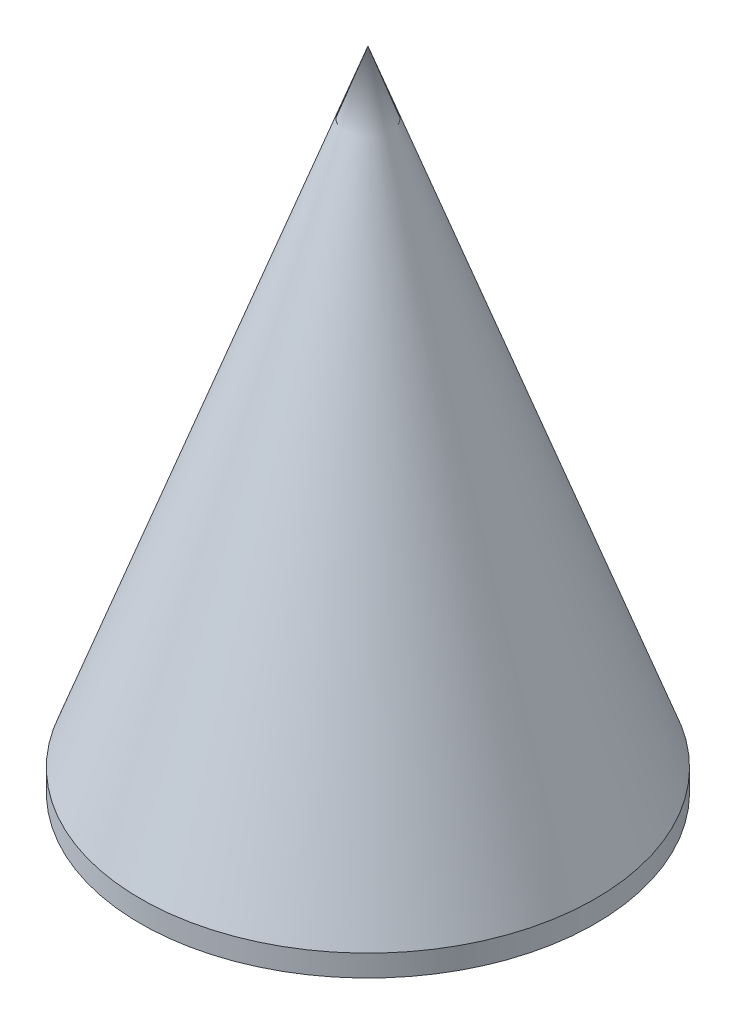
ISO-10303-21;
HEADER;
FILE_DESCRIPTION(('STEP AP214'),'2;1');
FILE_NAME('part.step','',(''),(''),'','','');
FILE_SCHEMA(('AUTOMOTIVE_DESIGN { 1 0 10303 214 1 1 1 1 }'));
ENDSEC;
DATA;
#1=APPLICATION_CONTEXT('core data for automotive mechanical design processes');
#2=APPLICATION_PROTOCOL_DEFINITION('international standard','automotive_design',2000,#1);
#3=PRODUCT_CONTEXT('',#1,'mechanical');
#4=PRODUCT('Part','Part','',(#3));
#5=PRODUCT_RELATED_PRODUCT_CATEGORY('part','',(#4));
#6=PRODUCT_DEFINITION_FORMATION('','',#4);
#7=PRODUCT_DEFINITION_CONTEXT('part definition',#1,'design');
#8=PRODUCT_DEFINITION('design','',#6,#7);
#9=PRODUCT_DEFINITION_SHAPE('','',#8);
#10=(LENGTH_UNIT() NAMED_UNIT(*) SI_UNIT(.MILLI.,.METRE.));
#11=(NAMED_UNIT(*) PLANE_ANGLE_UNIT() SI_UNIT($,.RADIAN.));
#12=(NAMED_UNIT(*) SI_UNIT($,.STERADIAN.) SOLID_ANGLE_UNIT());
#13=UNCERTAINTY_MEASURE_WITH_UNIT(LENGTH_MEASURE(1.E-05),#10,'distance_accuracy_value','');
#14=(GEOMETRIC_REPRESENTATION_CONTEXT(3) GLOBAL_UNCERTAINTY_ASSIGNED_CONTEXT((#13)) GLOBAL_UNIT_ASSIGNED_CONTEXT((#10,
#11,#12)) REPRESENTATION_CONTEXT('',''));
#15=CARTESIAN_POINT('',(0.,0.,0.));
#16=DIRECTION('',(0.,0.,1.));
#17=DIRECTION('',(1.,0.,0.));
#18=AXIS2_PLACEMENT_3D('',#15,#16,#17);
#19=CARTESIAN_POINT('',(0.,0.,0.));
#20=DIRECTION('',(0.,-1.,0.));
#21=DIRECTION('',(0.,0.,-1.));
#22=AXIS2_PLACEMENT_3D('',#19,#20,#21);
#23=CYLINDRICAL_SURFACE('',#22,22.225);
#24=CARTESIAN_POINT('',(0.,0.,0.));
#25=DIRECTION('',(0.,-1.,0.));
#26=DIRECTION('',(0.,0.,-1.));
#27=AXIS2_PLACEMENT_3D('',#24,#25,#26);
#28=CIRCLE('',#27,22.225);
#29=CARTESIAN_POINT('',(0.,0.,-22.225));
#30=VERTEX_POINT('',#29);
#31=EDGE_CURVE('E11',#30,#30,#28,.T.);
#32=ORIENTED_EDGE('',*,*,#31,.F.);
#33=EDGE_LOOP('',(#32));
#34=FACE_BOUND('',#33,.T.);
#35=CARTESIAN_POINT('',(0.,2.1082,0.));
#36=DIRECTION('',(0.,-1.,0.));
#37=DIRECTION('',(0.,0.,-1.));
#38=AXIS2_PLACEMENT_3D('',#35,#36,#37);
#39=CIRCLE('',#38,22.225);
#40=CARTESIAN_POINT('',(0.,2.1082,-22.225));
#41=VERTEX_POINT('',#40);
#42=EDGE_CURVE('E56',#41,#41,#39,.T.);
#43=ORIENTED_EDGE('',*,*,#42,.T.);
#44=EDGE_LOOP('',(#43));
#45=FACE_BOUND('',#44,.T.);
#46=ADVANCED_FACE('F32',(#34,#45),#23,.T.);
#47=CARTESIAN_POINT('',(1.5875,0.,0.));
#48=DIRECTION('',(0.,1.,0.));
#49=DIRECTION('',(0.,0.,1.));
#50=AXIS2_PLACEMENT_3D('',#47,#48,#49);
#51=PLANE('',#50);
#52=CARTESIAN_POINT('',(0.,0.,0.));
#53=DIRECTION('',(0.,-1.,0.));
#54=DIRECTION('',(0.,0.,-1.));
#55=AXIS2_PLACEMENT_3D('',#52,#53,#54);
#56=CIRCLE('',#55,1.5875);
#57=CARTESIAN_POINT('',(0.,0.,-1.5875));
#58=VERTEX_POINT('',#57);
#59=EDGE_CURVE('E39',#58,#58,#56,.T.);
#60=ORIENTED_EDGE('',*,*,#59,.F.);
#61=EDGE_LOOP('',(#60));
#62=FACE_BOUND('',#61,.T.);
#63=ORIENTED_EDGE('',*,*,#31,.T.);
#64=EDGE_LOOP('',(#63));
#65=FACE_BOUND('',#64,.T.);
#66=ADVANCED_FACE('F73',(#62,#65),#51,.F.);
#67=CARTESIAN_POINT('',(0.,0.,0.));
#68=DIRECTION('',(0.,-1.,0.));
#69=DIRECTION('',(0.,0.,-1.));
#70=AXIS2_PLACEMENT_3D('',#67,#68,#69);
#71=CYLINDRICAL_SURFACE('',#70,1.5875);
#72=CARTESIAN_POINT('',(0.,6.35,0.));
#73=DIRECTION('',(0.,-1.,0.));
#74=DIRECTION('',(0.,0.,-1.));
#75=AXIS2_PLACEMENT_3D('',#72,#73,#74);
#76=CIRCLE('',#75,1.5875);
#77=CARTESIAN_POINT('',(0.,6.35,-1.5875));
#78=VERTEX_POINT('',#77);
#79=EDGE_CURVE('E66',#78,#78,#76,.T.);
#80=ORIENTED_EDGE('',*,*,#79,.F.);
#81=EDGE_LOOP('',(#80));
#82=FACE_BOUND('',#81,.T.);
#83=ORIENTED_EDGE('',*,*,#59,.T.);
#84=EDGE_LOOP('',(#83));
#85=FACE_BOUND('',#84,.T.);
#86=ADVANCED_FACE('F71',(#82,#85),#71,.F.);
#87=CARTESIAN_POINT('',(1.5875,6.35,0.));
#88=DIRECTION('',(0.,-1.,0.));
#89=DIRECTION('',(0.,0.,-1.));
#90=AXIS2_PLACEMENT_3D('',#87,#88,#89);
#91=PLANE('',#90);
#92=CARTESIAN_POINT('',(0.,6.35,0.));
#93=DIRECTION('',(0.,-1.,0.));
#94=DIRECTION('',(0.,0.,-1.));
#95=AXIS2_PLACEMENT_3D('',#92,#93,#94);
#96=CIRCLE('',#95,6.35);
#97=CARTESIAN_POINT('',(0.,6.35,-6.35));
#98=VERTEX_POINT('',#97);
#99=EDGE_CURVE('E59',#98,#98,#96,.T.);
#100=ORIENTED_EDGE('',*,*,#99,.F.);
#101=EDGE_LOOP('',(#100));
#102=FACE_BOUND('',#101,.T.);
#103=ORIENTED_EDGE('',*,*,#79,.T.);
#104=EDGE_LOOP('',(#103));
#105=FACE_BOUND('',#104,.T.);
#106=ADVANCED_FACE('F92',(#102,#105),#91,.F.);
#107=CARTESIAN_POINT('',(0.,0.,0.));
#108=DIRECTION('',(0.,-1.,0.));
#109=DIRECTION('',(0.,0.,-1.));
#110=AXIS2_PLACEMENT_3D('',#107,#108,#109);
#111=CYLINDRICAL_SURFACE('',#110,6.35);
#112=CARTESIAN_POINT('',(0.,2.1082,0.));
#113=DIRECTION('',(0.,-1.,0.));
#114=DIRECTION('',(0.,0.,-1.));
#115=AXIS2_PLACEMENT_3D('',#112,#113,#114);
#116=CIRCLE('',#115,6.35);
#117=CARTESIAN_POINT('',(0.,2.1082,-6.35));
#118=VERTEX_POINT('',#117);
#119=EDGE_CURVE('E55',#118,#118,#116,.T.);
#120=ORIENTED_EDGE('',*,*,#119,.F.);
#121=EDGE_LOOP('',(#120));
#122=FACE_BOUND('',#121,.T.);
#123=ORIENTED_EDGE('',*,*,#99,.T.);
#124=EDGE_LOOP('',(#123));
#125=FACE_BOUND('',#124,.T.);
#126=ADVANCED_FACE('F89',(#122,#125),#111,.T.);
#127=CARTESIAN_POINT('',(6.35,2.1082,0.));
#128=DIRECTION('',(0.,-1.,0.));
#129=DIRECTION('',(0.,0.,-1.));
#130=AXIS2_PLACEMENT_3D('',#127,#128,#129);
#131=PLANE('',#130);
#132=CARTESIAN_POINT('',(0.,2.1082,0.));
#133=DIRECTION('',(0.,-1.,0.));
#134=DIRECTION('',(0.,0.,-1.));
#135=AXIS2_PLACEMENT_3D('',#132,#133,#134);
#136=CIRCLE('',#135,21.1836);
#137=CARTESIAN_POINT('',(0.,2.1082,-21.1836));
#138=VERTEX_POINT('',#137);
#139=EDGE_CURVE('E53',#138,#138,#136,.T.);
#140=ORIENTED_EDGE('',*,*,#139,.F.);
#141=EDGE_LOOP('',(#140));
#142=FACE_BOUND('',#141,.T.);
#143=ORIENTED_EDGE('',*,*,#119,.T.);
#144=EDGE_LOOP('',(#143));
#145=FACE_BOUND('',#144,.T.);
#146=ADVANCED_FACE('F49',(#142,#145),#131,.F.);
#147=CARTESIAN_POINT('',(0.,2.1082,0.));
#148=DIRECTION('',(0.,-1.,0.));
#149=DIRECTION('',(0.,0.,-1.));
#150=AXIS2_PLACEMENT_3D('',#147,#148,#149);
#151=CONICAL_SURFACE('',#150,21.1836,0.349065850398863);
#152=CARTESIAN_POINT('',(0.,60.3096626627595,0.));
#153=VERTEX_POINT('',#152);
#154=VERTEX_LOOP('',#153);
#155=FACE_BOUND('',#154,.T.);
#156=ORIENTED_EDGE('',*,*,#139,.T.);
#157=EDGE_LOOP('',(#156));
#158=FACE_BOUND('',#157,.T.);
#159=ADVANCED_FACE('F45',(#155,#158),#151,.F.);
#160=CARTESIAN_POINT('',(0.,63.1708856473796,0.));
#161=DIRECTION('',(0.,-1.,0.));
#162=DIRECTION('',(0.,0.,-1.));
#163=AXIS2_PLACEMENT_3D('',#160,#161,#162);
#164=CONICAL_SURFACE('',#163,0.,0.349065850398862);
#165=ORIENTED_EDGE('',*,*,#42,.F.);
#166=EDGE_LOOP('',(#165));
#167=FACE_BOUND('',#166,.T.);
#168=CARTESIAN_POINT('',(0.,63.1708856473796,0.));
#169=VERTEX_POINT('',#168);
#170=VERTEX_LOOP('',#169);
#171=FACE_BOUND('',#170,.T.);
#172=ADVANCED_FACE('F48',(#167,#171),#164,.T.);
#173=CLOSED_SHELL('',(#46,#66,#86,#106,#126,#146,#159,#172));
#174=MANIFOLD_SOLID_BREP('B2',#173);
#175=ADVANCED_BREP_SHAPE_REPRESENTATION('',(#18,#174),#14);
#176=SHAPE_DEFINITION_REPRESENTATION(#9,#175);
ENDSEC;
END-ISO-10303-21;
